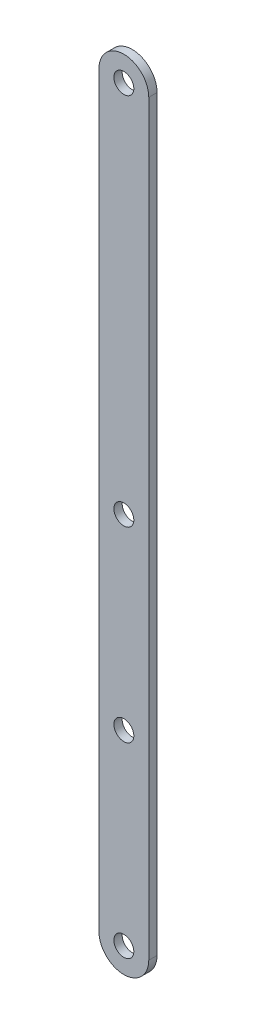
ISO-10303-21;
HEADER;
FILE_DESCRIPTION(('STEP AP214'),'2;1');
FILE_NAME('part.step','',(''),(''),'','','');
FILE_SCHEMA(('AUTOMOTIVE_DESIGN { 1 0 10303 214 1 1 1 1 }'));
ENDSEC;
DATA;
#1=APPLICATION_CONTEXT('core data for automotive mechanical design processes');
#2=APPLICATION_PROTOCOL_DEFINITION('international standard','automotive_design',2000,#1);
#3=PRODUCT_CONTEXT('',#1,'mechanical');
#4=PRODUCT('Part','Part','',(#3));
#5=PRODUCT_RELATED_PRODUCT_CATEGORY('part','',(#4));
#6=PRODUCT_DEFINITION_FORMATION('','',#4);
#7=PRODUCT_DEFINITION_CONTEXT('part definition',#1,'design');
#8=PRODUCT_DEFINITION('design','',#6,#7);
#9=PRODUCT_DEFINITION_SHAPE('','',#8);
#10=(LENGTH_UNIT() NAMED_UNIT(*) SI_UNIT(.MILLI.,.METRE.));
#11=(NAMED_UNIT(*) PLANE_ANGLE_UNIT() SI_UNIT($,.RADIAN.));
#12=(NAMED_UNIT(*) SI_UNIT($,.STERADIAN.) SOLID_ANGLE_UNIT());
#13=UNCERTAINTY_MEASURE_WITH_UNIT(LENGTH_MEASURE(1.E-05),#10,'distance_accuracy_value','');
#14=(GEOMETRIC_REPRESENTATION_CONTEXT(3) GLOBAL_UNCERTAINTY_ASSIGNED_CONTEXT((#13)) GLOBAL_UNIT_ASSIGNED_CONTEXT((#10,
#11,#12)) REPRESENTATION_CONTEXT('',''));
#15=CARTESIAN_POINT('',(0.,0.,0.));
#16=DIRECTION('',(0.,0.,1.));
#17=DIRECTION('',(1.,0.,0.));
#18=AXIS2_PLACEMENT_3D('',#15,#16,#17);
#19=CARTESIAN_POINT('',(23.3631138751007,62.6957680311895,5.));
#20=DIRECTION('',(0.,0.,1.));
#21=DIRECTION('',(1.,0.,0.));
#22=AXIS2_PLACEMENT_3D('',#19,#20,#21);
#23=PLANE('',#22);
#24=CARTESIAN_POINT('',(23.3631138751007,287.69576803119,5.));
#25=DIRECTION('',(0.,0.,1.));
#26=DIRECTION('',(1.,0.,0.));
#27=AXIS2_PLACEMENT_3D('',#24,#25,#26);
#28=CIRCLE('',#27,6.);
#29=CARTESIAN_POINT('',(29.3631138751007,287.69576803119,5.));
#30=VERTEX_POINT('',#29);
#31=EDGE_CURVE('E123',#30,#30,#28,.T.);
#32=ORIENTED_EDGE('',*,*,#31,.F.);
#33=EDGE_LOOP('',(#32));
#34=FACE_BOUND('',#33,.T.);
#35=CARTESIAN_POINT('',(23.3631138751007,512.69576803119,5.));
#36=DIRECTION('',(0.,0.,1.));
#37=DIRECTION('',(1.,0.,0.));
#38=AXIS2_PLACEMENT_3D('',#35,#36,#37);
#39=CIRCLE('',#38,6.);
#40=CARTESIAN_POINT('',(29.3631138751007,512.69576803119,5.));
#41=VERTEX_POINT('',#40);
#42=EDGE_CURVE('E102',#41,#41,#39,.T.);
#43=ORIENTED_EDGE('',*,*,#42,.F.);
#44=EDGE_LOOP('',(#43));
#45=FACE_BOUND('',#44,.T.);
#46=CARTESIAN_POINT('',(23.3631138751007,62.6957680311895,5.));
#47=DIRECTION('',(0.,0.,1.));
#48=DIRECTION('',(1.,0.,0.));
#49=AXIS2_PLACEMENT_3D('',#46,#47,#48);
#50=CIRCLE('',#49,15.);
#51=CARTESIAN_POINT('',(8.36311387510069,62.6957680311895,5.));
#52=VERTEX_POINT('',#51);
#53=CARTESIAN_POINT('',(38.3631138751007,62.6957680311895,5.));
#54=VERTEX_POINT('',#53);
#55=EDGE_CURVE('E87',#52,#54,#50,.T.);
#56=ORIENTED_EDGE('',*,*,#55,.T.);
#57=DIRECTION('',(0.,1.,0.));
#58=VECTOR('',#57,1.);
#59=CARTESIAN_POINT('',(38.3631138751007,512.69576803119,5.));
#60=LINE('',#59,#58);
#61=CARTESIAN_POINT('',(38.3631138751007,512.69576803119,5.));
#62=VERTEX_POINT('',#61);
#63=EDGE_CURVE('E82',#54,#62,#60,.T.);
#64=ORIENTED_EDGE('',*,*,#63,.T.);
#65=CARTESIAN_POINT('',(23.3631138751007,512.69576803119,5.));
#66=DIRECTION('',(0.,0.,1.));
#67=DIRECTION('',(1.,0.,0.));
#68=AXIS2_PLACEMENT_3D('',#65,#66,#67);
#69=CIRCLE('',#68,15.);
#70=CARTESIAN_POINT('',(8.36311387510069,512.69576803119,5.));
#71=VERTEX_POINT('',#70);
#72=EDGE_CURVE('E85',#62,#71,#69,.T.);
#73=ORIENTED_EDGE('',*,*,#72,.T.);
#74=DIRECTION('',(0.,-1.,0.));
#75=VECTOR('',#74,1.);
#76=CARTESIAN_POINT('',(8.36311387510069,62.6957680311895,5.));
#77=LINE('',#76,#75);
#78=EDGE_CURVE('E52',#71,#52,#77,.T.);
#79=ORIENTED_EDGE('',*,*,#78,.T.);
#80=EDGE_LOOP('',(#56,#64,#73,#79));
#81=FACE_BOUND('',#80,.T.);
#82=CARTESIAN_POINT('',(23.3631138751007,62.6957680311895,5.));
#83=DIRECTION('',(0.,0.,1.));
#84=DIRECTION('',(1.,0.,0.));
#85=AXIS2_PLACEMENT_3D('',#82,#83,#84);
#86=CIRCLE('',#85,6.);
#87=CARTESIAN_POINT('',(29.3631138751007,62.6957680311895,5.));
#88=VERTEX_POINT('',#87);
#89=EDGE_CURVE('E117',#88,#88,#86,.T.);
#90=ORIENTED_EDGE('',*,*,#89,.F.);
#91=EDGE_LOOP('',(#90));
#92=FACE_BOUND('',#91,.T.);
#93=CARTESIAN_POINT('',(23.3631138751007,175.19576803119,5.));
#94=DIRECTION('',(0.,0.,1.));
#95=DIRECTION('',(-1.,0.,0.));
#96=AXIS2_PLACEMENT_3D('',#93,#94,#95);
#97=CIRCLE('',#96,5.99999999999998);
#98=CARTESIAN_POINT('',(17.3631138751007,175.19576803119,5.));
#99=VERTEX_POINT('',#98);
#100=EDGE_CURVE('E129',#99,#99,#97,.T.);
#101=ORIENTED_EDGE('',*,*,#100,.F.);
#102=EDGE_LOOP('',(#101));
#103=FACE_BOUND('',#102,.T.);
#104=ADVANCED_FACE('F35',(#34,#45,#81,#92,#103),#23,.T.);
#105=CARTESIAN_POINT('',(23.3631138751007,62.6957680311895,0.));
#106=DIRECTION('',(0.,0.,1.));
#107=DIRECTION('',(1.,0.,0.));
#108=AXIS2_PLACEMENT_3D('',#105,#106,#107);
#109=PLANE('',#108);
#110=CARTESIAN_POINT('',(23.3631138751007,62.6957680311895,0.));
#111=DIRECTION('',(0.,0.,1.));
#112=DIRECTION('',(1.,0.,0.));
#113=AXIS2_PLACEMENT_3D('',#110,#111,#112);
#114=CIRCLE('',#113,15.);
#115=CARTESIAN_POINT('',(8.36311387510069,62.6957680311895,0.));
#116=VERTEX_POINT('',#115);
#117=CARTESIAN_POINT('',(38.3631138751007,62.6957680311895,0.));
#118=VERTEX_POINT('',#117);
#119=EDGE_CURVE('E99',#116,#118,#114,.T.);
#120=ORIENTED_EDGE('',*,*,#119,.F.);
#121=DIRECTION('',(0.,-1.,0.));
#122=VECTOR('',#121,1.);
#123=CARTESIAN_POINT('',(8.36311387510069,62.6957680311895,0.));
#124=LINE('',#123,#122);
#125=CARTESIAN_POINT('',(8.36311387510069,512.69576803119,0.));
#126=VERTEX_POINT('',#125);
#127=EDGE_CURVE('E75',#126,#116,#124,.T.);
#128=ORIENTED_EDGE('',*,*,#127,.F.);
#129=CARTESIAN_POINT('',(23.3631138751007,512.69576803119,0.));
#130=DIRECTION('',(0.,0.,1.));
#131=DIRECTION('',(1.,0.,0.));
#132=AXIS2_PLACEMENT_3D('',#129,#130,#131);
#133=CIRCLE('',#132,15.);
#134=CARTESIAN_POINT('',(38.3631138751007,512.69576803119,0.));
#135=VERTEX_POINT('',#134);
#136=EDGE_CURVE('E69',#135,#126,#133,.T.);
#137=ORIENTED_EDGE('',*,*,#136,.F.);
#138=DIRECTION('',(0.,1.,0.));
#139=VECTOR('',#138,1.);
#140=CARTESIAN_POINT('',(38.3631138751007,512.69576803119,0.));
#141=LINE('',#140,#139);
#142=EDGE_CURVE('E91',#118,#135,#141,.T.);
#143=ORIENTED_EDGE('',*,*,#142,.F.);
#144=EDGE_LOOP('',(#120,#128,#137,#143));
#145=FACE_BOUND('',#144,.T.);
#146=CARTESIAN_POINT('',(23.3631138751007,512.69576803119,0.));
#147=DIRECTION('',(0.,0.,1.));
#148=DIRECTION('',(1.,0.,0.));
#149=AXIS2_PLACEMENT_3D('',#146,#147,#148);
#150=CIRCLE('',#149,6.);
#151=CARTESIAN_POINT('',(29.3631138751007,512.69576803119,0.));
#152=VERTEX_POINT('',#151);
#153=EDGE_CURVE('E114',#152,#152,#150,.T.);
#154=ORIENTED_EDGE('',*,*,#153,.T.);
#155=EDGE_LOOP('',(#154));
#156=FACE_BOUND('',#155,.T.);
#157=CARTESIAN_POINT('',(23.3631138751007,62.6957680311895,0.));
#158=DIRECTION('',(0.,0.,1.));
#159=DIRECTION('',(1.,0.,0.));
#160=AXIS2_PLACEMENT_3D('',#157,#158,#159);
#161=CIRCLE('',#160,6.);
#162=CARTESIAN_POINT('',(29.3631138751007,62.6957680311895,0.));
#163=VERTEX_POINT('',#162);
#164=EDGE_CURVE('E120',#163,#163,#161,.T.);
#165=ORIENTED_EDGE('',*,*,#164,.T.);
#166=EDGE_LOOP('',(#165));
#167=FACE_BOUND('',#166,.T.);
#168=CARTESIAN_POINT('',(23.3631138751007,287.69576803119,0.));
#169=DIRECTION('',(0.,0.,1.));
#170=DIRECTION('',(1.,0.,0.));
#171=AXIS2_PLACEMENT_3D('',#168,#169,#170);
#172=CIRCLE('',#171,6.);
#173=CARTESIAN_POINT('',(29.3631138751007,287.69576803119,0.));
#174=VERTEX_POINT('',#173);
#175=EDGE_CURVE('E126',#174,#174,#172,.T.);
#176=ORIENTED_EDGE('',*,*,#175,.T.);
#177=EDGE_LOOP('',(#176));
#178=FACE_BOUND('',#177,.T.);
#179=CARTESIAN_POINT('',(23.3631138751007,175.19576803119,0.));
#180=DIRECTION('',(0.,0.,1.));
#181=DIRECTION('',(-1.,0.,0.));
#182=AXIS2_PLACEMENT_3D('',#179,#180,#181);
#183=CIRCLE('',#182,5.99999999999998);
#184=CARTESIAN_POINT('',(17.3631138751007,175.19576803119,0.));
#185=VERTEX_POINT('',#184);
#186=EDGE_CURVE('E132',#185,#185,#183,.T.);
#187=ORIENTED_EDGE('',*,*,#186,.T.);
#188=EDGE_LOOP('',(#187));
#189=FACE_BOUND('',#188,.T.);
#190=ADVANCED_FACE('F110',(#145,#156,#167,#178,#189),#109,.F.);
#191=CARTESIAN_POINT('',(23.3631138751007,62.6957680311895,5.));
#192=DIRECTION('',(0.,0.,-1.));
#193=DIRECTION('',(-1.,0.,0.));
#194=AXIS2_PLACEMENT_3D('',#191,#192,#193);
#195=CYLINDRICAL_SURFACE('',#194,15.);
#196=ORIENTED_EDGE('',*,*,#119,.T.);
#197=DIRECTION('',(0.,0.,-1.));
#198=VECTOR('',#197,1.);
#199=CARTESIAN_POINT('',(38.3631138751007,62.6957680311895,5.));
#200=LINE('',#199,#198);
#201=EDGE_CURVE('E11',#54,#118,#200,.T.);
#202=ORIENTED_EDGE('',*,*,#201,.F.);
#203=ORIENTED_EDGE('',*,*,#55,.F.);
#204=DIRECTION('',(0.,0.,-1.));
#205=VECTOR('',#204,1.);
#206=CARTESIAN_POINT('',(8.36311387510069,62.6957680311895,5.));
#207=LINE('',#206,#205);
#208=EDGE_CURVE('E95',#52,#116,#207,.T.);
#209=ORIENTED_EDGE('',*,*,#208,.T.);
#210=EDGE_LOOP('',(#196,#202,#203,#209));
#211=FACE_BOUND('',#210,.T.);
#212=ADVANCED_FACE('F37',(#211),#195,.T.);
#213=CARTESIAN_POINT('',(38.3631138751007,512.69576803119,5.));
#214=DIRECTION('',(-1.,0.,0.));
#215=DIRECTION('',(0.,-1.,0.));
#216=AXIS2_PLACEMENT_3D('',#213,#214,#215);
#217=PLANE('',#216);
#218=ORIENTED_EDGE('',*,*,#142,.T.);
#219=DIRECTION('',(0.,0.,-1.));
#220=VECTOR('',#219,1.);
#221=CARTESIAN_POINT('',(38.3631138751007,512.69576803119,5.));
#222=LINE('',#221,#220);
#223=EDGE_CURVE('E44',#62,#135,#222,.T.);
#224=ORIENTED_EDGE('',*,*,#223,.F.);
#225=ORIENTED_EDGE('',*,*,#63,.F.);
#226=ORIENTED_EDGE('',*,*,#201,.T.);
#227=EDGE_LOOP('',(#218,#224,#225,#226));
#228=FACE_BOUND('',#227,.T.);
#229=ADVANCED_FACE('F90',(#228),#217,.F.);
#230=CARTESIAN_POINT('',(23.3631138751007,512.69576803119,5.));
#231=DIRECTION('',(0.,0.,-1.));
#232=DIRECTION('',(-1.,0.,0.));
#233=AXIS2_PLACEMENT_3D('',#230,#231,#232);
#234=CYLINDRICAL_SURFACE('',#233,15.);
#235=ORIENTED_EDGE('',*,*,#136,.T.);
#236=DIRECTION('',(0.,0.,-1.));
#237=VECTOR('',#236,1.);
#238=CARTESIAN_POINT('',(8.36311387510069,512.69576803119,5.));
#239=LINE('',#238,#237);
#240=EDGE_CURVE('E92',#71,#126,#239,.T.);
#241=ORIENTED_EDGE('',*,*,#240,.F.);
#242=ORIENTED_EDGE('',*,*,#72,.F.);
#243=ORIENTED_EDGE('',*,*,#223,.T.);
#244=EDGE_LOOP('',(#235,#241,#242,#243));
#245=FACE_BOUND('',#244,.T.);
#246=ADVANCED_FACE('F93',(#245),#234,.T.);
#247=CARTESIAN_POINT('',(8.36311387510069,62.6957680311895,5.));
#248=DIRECTION('',(1.,0.,0.));
#249=DIRECTION('',(0.,0.,-1.));
#250=AXIS2_PLACEMENT_3D('',#247,#248,#249);
#251=PLANE('',#250);
#252=ORIENTED_EDGE('',*,*,#127,.T.);
#253=ORIENTED_EDGE('',*,*,#208,.F.);
#254=ORIENTED_EDGE('',*,*,#78,.F.);
#255=ORIENTED_EDGE('',*,*,#240,.T.);
#256=EDGE_LOOP('',(#252,#253,#254,#255));
#257=FACE_BOUND('',#256,.T.);
#258=ADVANCED_FACE('F107',(#257),#251,.F.);
#259=CARTESIAN_POINT('',(23.3631138751007,512.69576803119,5.));
#260=DIRECTION('',(0.,0.,-1.));
#261=DIRECTION('',(-1.,0.,0.));
#262=AXIS2_PLACEMENT_3D('',#259,#260,#261);
#263=CYLINDRICAL_SURFACE('',#262,6.);
#264=ORIENTED_EDGE('',*,*,#42,.T.);
#265=EDGE_LOOP('',(#264));
#266=FACE_BOUND('',#265,.T.);
#267=ORIENTED_EDGE('',*,*,#153,.F.);
#268=EDGE_LOOP('',(#267));
#269=FACE_BOUND('',#268,.T.);
#270=ADVANCED_FACE('F151',(#266,#269),#263,.F.);
#271=CARTESIAN_POINT('',(23.3631138751007,62.6957680311895,5.));
#272=DIRECTION('',(0.,0.,-1.));
#273=DIRECTION('',(-1.,0.,0.));
#274=AXIS2_PLACEMENT_3D('',#271,#272,#273);
#275=CYLINDRICAL_SURFACE('',#274,6.);
#276=ORIENTED_EDGE('',*,*,#89,.T.);
#277=EDGE_LOOP('',(#276));
#278=FACE_BOUND('',#277,.T.);
#279=ORIENTED_EDGE('',*,*,#164,.F.);
#280=EDGE_LOOP('',(#279));
#281=FACE_BOUND('',#280,.T.);
#282=ADVANCED_FACE('F197',(#278,#281),#275,.F.);
#283=CARTESIAN_POINT('',(23.3631138751007,287.69576803119,5.));
#284=DIRECTION('',(0.,0.,-1.));
#285=DIRECTION('',(-1.,0.,0.));
#286=AXIS2_PLACEMENT_3D('',#283,#284,#285);
#287=CYLINDRICAL_SURFACE('',#286,6.);
#288=ORIENTED_EDGE('',*,*,#31,.T.);
#289=EDGE_LOOP('',(#288));
#290=FACE_BOUND('',#289,.T.);
#291=ORIENTED_EDGE('',*,*,#175,.F.);
#292=EDGE_LOOP('',(#291));
#293=FACE_BOUND('',#292,.T.);
#294=ADVANCED_FACE('F205',(#290,#293),#287,.F.);
#295=CARTESIAN_POINT('',(23.3631138751007,175.19576803119,5.));
#296=DIRECTION('',(0.,0.,-1.));
#297=DIRECTION('',(-1.,0.,0.));
#298=AXIS2_PLACEMENT_3D('',#295,#296,#297);
#299=CYLINDRICAL_SURFACE('',#298,5.99999999999998);
#300=ORIENTED_EDGE('',*,*,#100,.T.);
#301=EDGE_LOOP('',(#300));
#302=FACE_BOUND('',#301,.T.);
#303=ORIENTED_EDGE('',*,*,#186,.F.);
#304=EDGE_LOOP('',(#303));
#305=FACE_BOUND('',#304,.T.);
#306=ADVANCED_FACE('F138',(#302,#305),#299,.F.);
#307=CLOSED_SHELL('',(#104,#190,#212,#229,#246,#258,#270,#282,#294,#306));
#308=MANIFOLD_SOLID_BREP('B2',#307);
#309=ADVANCED_BREP_SHAPE_REPRESENTATION('',(#18,#308),#14);
#310=SHAPE_DEFINITION_REPRESENTATION(#9,#309);
ENDSEC;
END-ISO-10303-21;
